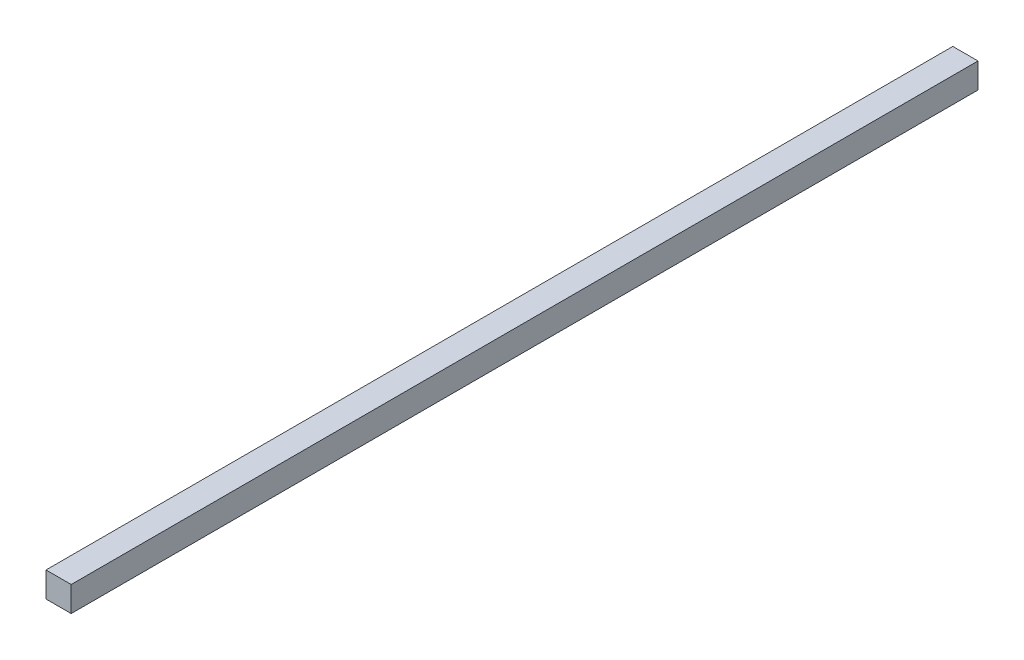
ISO-10303-21;
HEADER;
FILE_DESCRIPTION(('STEP AP214'),'2;1');
FILE_NAME('part.step','',(''),(''),'','','');
FILE_SCHEMA(('AUTOMOTIVE_DESIGN { 1 0 10303 214 1 1 1 1 }'));
ENDSEC;
DATA;
#1=APPLICATION_CONTEXT('core data for automotive mechanical design processes');
#2=APPLICATION_PROTOCOL_DEFINITION('international standard','automotive_design',2000,#1);
#3=PRODUCT_CONTEXT('',#1,'mechanical');
#4=PRODUCT('Part','Part','',(#3));
#5=PRODUCT_RELATED_PRODUCT_CATEGORY('part','',(#4));
#6=PRODUCT_DEFINITION_FORMATION('','',#4);
#7=PRODUCT_DEFINITION_CONTEXT('part definition',#1,'design');
#8=PRODUCT_DEFINITION('design','',#6,#7);
#9=PRODUCT_DEFINITION_SHAPE('','',#8);
#10=(LENGTH_UNIT() NAMED_UNIT(*) SI_UNIT(.MILLI.,.METRE.));
#11=(NAMED_UNIT(*) PLANE_ANGLE_UNIT() SI_UNIT($,.RADIAN.));
#12=(NAMED_UNIT(*) SI_UNIT($,.STERADIAN.) SOLID_ANGLE_UNIT());
#13=UNCERTAINTY_MEASURE_WITH_UNIT(LENGTH_MEASURE(1.E-05),#10,'distance_accuracy_value','');
#14=(GEOMETRIC_REPRESENTATION_CONTEXT(3) GLOBAL_UNCERTAINTY_ASSIGNED_CONTEXT((#13)) GLOBAL_UNIT_ASSIGNED_CONTEXT((#10,
#11,#12)) REPRESENTATION_CONTEXT('',''));
#15=CARTESIAN_POINT('',(0.,0.,0.));
#16=DIRECTION('',(0.,0.,1.));
#17=DIRECTION('',(1.,0.,0.));
#18=AXIS2_PLACEMENT_3D('',#15,#16,#17);
#19=CARTESIAN_POINT('',(12.7,-12.7,914.4));
#20=DIRECTION('',(-1.,0.,0.));
#21=DIRECTION('',(0.,0.,1.));
#22=AXIS2_PLACEMENT_3D('',#19,#20,#21);
#23=PLANE('',#22);
#24=DIRECTION('',(0.,1.,0.));
#25=VECTOR('',#24,1.);
#26=CARTESIAN_POINT('',(12.7,-12.7,0.));
#27=LINE('',#26,#25);
#28=CARTESIAN_POINT('',(12.7,-12.7,0.));
#29=VERTEX_POINT('',#28);
#30=CARTESIAN_POINT('',(12.7,12.7,0.));
#31=VERTEX_POINT('',#30);
#32=EDGE_CURVE('E107',#29,#31,#27,.T.);
#33=ORIENTED_EDGE('',*,*,#32,.T.);
#34=DIRECTION('',(0.,0.,-1.));
#35=VECTOR('',#34,1.);
#36=CARTESIAN_POINT('',(12.7,12.7,914.4));
#37=LINE('',#36,#35);
#38=CARTESIAN_POINT('',(12.7,12.7,914.4));
#39=VERTEX_POINT('',#38);
#40=EDGE_CURVE('E11',#39,#31,#37,.T.);
#41=ORIENTED_EDGE('',*,*,#40,.F.);
#42=DIRECTION('',(0.,1.,0.));
#43=VECTOR('',#42,1.);
#44=CARTESIAN_POINT('',(12.7,-12.7,914.4));
#45=LINE('',#44,#43);
#46=CARTESIAN_POINT('',(12.7,-12.7,914.4));
#47=VERTEX_POINT('',#46);
#48=EDGE_CURVE('E91',#47,#39,#45,.T.);
#49=ORIENTED_EDGE('',*,*,#48,.F.);
#50=DIRECTION('',(0.,0.,-1.));
#51=VECTOR('',#50,1.);
#52=CARTESIAN_POINT('',(12.7,-12.7,914.4));
#53=LINE('',#52,#51);
#54=EDGE_CURVE('E103',#47,#29,#53,.T.);
#55=ORIENTED_EDGE('',*,*,#54,.T.);
#56=EDGE_LOOP('',(#33,#41,#49,#55));
#57=FACE_BOUND('',#56,.T.);
#58=ADVANCED_FACE('F39',(#57),#23,.F.);
#59=CARTESIAN_POINT('',(-12.7,12.7,914.4));
#60=DIRECTION('',(0.,-1.,0.));
#61=DIRECTION('',(0.,0.,-1.));
#62=AXIS2_PLACEMENT_3D('',#59,#60,#61);
#63=PLANE('',#62);
#64=DIRECTION('',(-1.,0.,0.));
#65=VECTOR('',#64,1.);
#66=CARTESIAN_POINT('',(-12.7,12.7,0.));
#67=LINE('',#66,#65);
#68=CARTESIAN_POINT('',(-12.7,12.7,0.));
#69=VERTEX_POINT('',#68);
#70=EDGE_CURVE('E96',#31,#69,#67,.T.);
#71=ORIENTED_EDGE('',*,*,#70,.T.);
#72=DIRECTION('',(0.,0.,-1.));
#73=VECTOR('',#72,1.);
#74=CARTESIAN_POINT('',(-12.7,12.7,914.4));
#75=LINE('',#74,#73);
#76=CARTESIAN_POINT('',(-12.7,12.7,914.4));
#77=VERTEX_POINT('',#76);
#78=EDGE_CURVE('E48',#77,#69,#75,.T.);
#79=ORIENTED_EDGE('',*,*,#78,.F.);
#80=DIRECTION('',(-1.,0.,0.));
#81=VECTOR('',#80,1.);
#82=CARTESIAN_POINT('',(-12.7,12.7,914.4));
#83=LINE('',#82,#81);
#84=EDGE_CURVE('E86',#39,#77,#83,.T.);
#85=ORIENTED_EDGE('',*,*,#84,.F.);
#86=ORIENTED_EDGE('',*,*,#40,.T.);
#87=EDGE_LOOP('',(#71,#79,#85,#86));
#88=FACE_BOUND('',#87,.T.);
#89=ADVANCED_FACE('F95',(#88),#63,.F.);
#90=CARTESIAN_POINT('',(-12.7,-12.7,914.4));
#91=DIRECTION('',(1.,0.,0.));
#92=DIRECTION('',(0.,0.,-1.));
#93=AXIS2_PLACEMENT_3D('',#90,#91,#92);
#94=PLANE('',#93);
#95=DIRECTION('',(0.,-1.,0.));
#96=VECTOR('',#95,1.);
#97=CARTESIAN_POINT('',(-12.7,-12.7,0.));
#98=LINE('',#97,#96);
#99=CARTESIAN_POINT('',(-12.7,-12.7,0.));
#100=VERTEX_POINT('',#99);
#101=EDGE_CURVE('E73',#69,#100,#98,.T.);
#102=ORIENTED_EDGE('',*,*,#101,.T.);
#103=DIRECTION('',(0.,0.,-1.));
#104=VECTOR('',#103,1.);
#105=CARTESIAN_POINT('',(-12.7,-12.7,914.4));
#106=LINE('',#105,#104);
#107=CARTESIAN_POINT('',(-12.7,-12.7,914.4));
#108=VERTEX_POINT('',#107);
#109=EDGE_CURVE('E98',#108,#100,#106,.T.);
#110=ORIENTED_EDGE('',*,*,#109,.F.);
#111=DIRECTION('',(0.,-1.,0.));
#112=VECTOR('',#111,1.);
#113=CARTESIAN_POINT('',(-12.7,-12.7,914.4));
#114=LINE('',#113,#112);
#115=EDGE_CURVE('E89',#77,#108,#114,.T.);
#116=ORIENTED_EDGE('',*,*,#115,.F.);
#117=ORIENTED_EDGE('',*,*,#78,.T.);
#118=EDGE_LOOP('',(#102,#110,#116,#117));
#119=FACE_BOUND('',#118,.T.);
#120=ADVANCED_FACE('F99',(#119),#94,.F.);
#121=CARTESIAN_POINT('',(-12.7,-12.7,914.4));
#122=DIRECTION('',(0.,1.,0.));
#123=DIRECTION('',(0.,0.,1.));
#124=AXIS2_PLACEMENT_3D('',#121,#122,#123);
#125=PLANE('',#124);
#126=DIRECTION('',(1.,0.,0.));
#127=VECTOR('',#126,1.);
#128=CARTESIAN_POINT('',(-12.7,-12.7,0.));
#129=LINE('',#128,#127);
#130=EDGE_CURVE('E79',#100,#29,#129,.T.);
#131=ORIENTED_EDGE('',*,*,#130,.T.);
#132=ORIENTED_EDGE('',*,*,#54,.F.);
#133=DIRECTION('',(1.,0.,0.));
#134=VECTOR('',#133,1.);
#135=CARTESIAN_POINT('',(-12.7,-12.7,914.4));
#136=LINE('',#135,#134);
#137=EDGE_CURVE('E56',#108,#47,#136,.T.);
#138=ORIENTED_EDGE('',*,*,#137,.F.);
#139=ORIENTED_EDGE('',*,*,#109,.T.);
#140=EDGE_LOOP('',(#131,#132,#138,#139));
#141=FACE_BOUND('',#140,.T.);
#142=ADVANCED_FACE('F120',(#141),#125,.F.);
#143=CARTESIAN_POINT('',(0.,0.,914.4));
#144=DIRECTION('',(0.,0.,-1.));
#145=DIRECTION('',(-1.,0.,0.));
#146=AXIS2_PLACEMENT_3D('',#143,#144,#145);
#147=PLANE('',#146);
#148=ORIENTED_EDGE('',*,*,#48,.T.);
#149=ORIENTED_EDGE('',*,*,#84,.T.);
#150=ORIENTED_EDGE('',*,*,#115,.T.);
#151=ORIENTED_EDGE('',*,*,#137,.T.);
#152=EDGE_LOOP('',(#148,#149,#150,#151));
#153=FACE_BOUND('',#152,.T.);
#154=ADVANCED_FACE('F87',(#153),#147,.F.);
#155=CARTESIAN_POINT('',(0.,0.,0.));
#156=DIRECTION('',(0.,0.,-1.));
#157=DIRECTION('',(-1.,0.,0.));
#158=AXIS2_PLACEMENT_3D('',#155,#156,#157);
#159=PLANE('',#158);
#160=ORIENTED_EDGE('',*,*,#32,.F.);
#161=ORIENTED_EDGE('',*,*,#130,.F.);
#162=ORIENTED_EDGE('',*,*,#101,.F.);
#163=ORIENTED_EDGE('',*,*,#70,.F.);
#164=EDGE_LOOP('',(#160,#161,#162,#163));
#165=FACE_BOUND('',#164,.T.);
#166=ADVANCED_FACE('F123',(#165),#159,.T.);
#167=CLOSED_SHELL('',(#58,#89,#120,#142,#154,#166));
#168=MANIFOLD_SOLID_BREP('B2',#167);
#169=ADVANCED_BREP_SHAPE_REPRESENTATION('',(#18,#168),#14);
#170=SHAPE_DEFINITION_REPRESENTATION(#9,#169);
ENDSEC;
END-ISO-10303-21;
